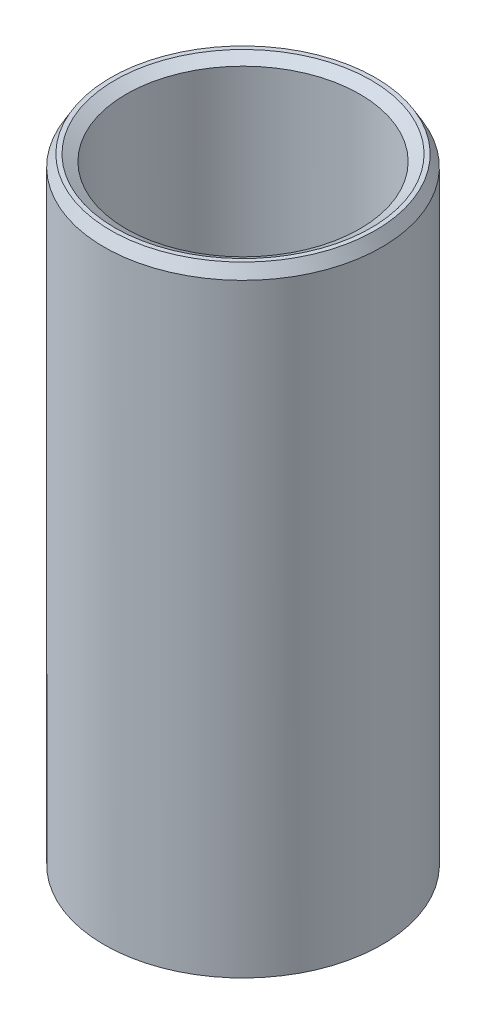
ISO-10303-21;
HEADER;
FILE_DESCRIPTION(('STEP AP214'),'2;1');
FILE_NAME('part.step','',(''),(''),'','','');
FILE_SCHEMA(('AUTOMOTIVE_DESIGN { 1 0 10303 214 1 1 1 1 }'));
ENDSEC;
DATA;
#1=APPLICATION_CONTEXT('core data for automotive mechanical design processes');
#2=APPLICATION_PROTOCOL_DEFINITION('international standard','automotive_design',2000,#1);
#3=PRODUCT_CONTEXT('',#1,'mechanical');
#4=PRODUCT('Part','Part','',(#3));
#5=PRODUCT_RELATED_PRODUCT_CATEGORY('part','',(#4));
#6=PRODUCT_DEFINITION_FORMATION('','',#4);
#7=PRODUCT_DEFINITION_CONTEXT('part definition',#1,'design');
#8=PRODUCT_DEFINITION('design','',#6,#7);
#9=PRODUCT_DEFINITION_SHAPE('','',#8);
#10=(LENGTH_UNIT() NAMED_UNIT(*) SI_UNIT(.MILLI.,.METRE.));
#11=(NAMED_UNIT(*) PLANE_ANGLE_UNIT() SI_UNIT($,.RADIAN.));
#12=(NAMED_UNIT(*) SI_UNIT($,.STERADIAN.) SOLID_ANGLE_UNIT());
#13=UNCERTAINTY_MEASURE_WITH_UNIT(LENGTH_MEASURE(1.E-05),#10,'distance_accuracy_value','');
#14=(GEOMETRIC_REPRESENTATION_CONTEXT(3) GLOBAL_UNCERTAINTY_ASSIGNED_CONTEXT((#13)) GLOBAL_UNIT_ASSIGNED_CONTEXT((#10,
#11,#12)) REPRESENTATION_CONTEXT('',''));
#15=CARTESIAN_POINT('',(0.,0.,0.));
#16=DIRECTION('',(0.,0.,1.));
#17=DIRECTION('',(1.,0.,0.));
#18=AXIS2_PLACEMENT_3D('',#15,#16,#17);
#19=CARTESIAN_POINT('',(0.,212.741151073881,0.));
#20=DIRECTION('',(0.,-1.,0.));
#21=DIRECTION('',(0.,0.,-1.));
#22=AXIS2_PLACEMENT_3D('',#19,#20,#21);
#23=CYLINDRICAL_SURFACE('',#22,47.5);
#24=CARTESIAN_POINT('',(0.,2.22241298728293,0.));
#25=DIRECTION('',(0.,1.,0.));
#26=DIRECTION('',(0.,0.,1.));
#27=AXIS2_PLACEMENT_3D('',#24,#25,#26);
#28=CIRCLE('',#27,47.5);
#29=CARTESIAN_POINT('',(0.,2.22241298728293,47.5));
#30=VERTEX_POINT('',#29);
#31=EDGE_CURVE('E10',#30,#30,#28,.T.);
#32=ORIENTED_EDGE('',*,*,#31,.T.);
#33=EDGE_LOOP('',(#32));
#34=FACE_BOUND('',#33,.T.);
#35=CARTESIAN_POINT('',(0.,208.891818864506,0.));
#36=DIRECTION('',(0.,1.,0.));
#37=DIRECTION('',(0.,0.,1.));
#38=AXIS2_PLACEMENT_3D('',#35,#36,#37);
#39=CIRCLE('',#38,47.5);
#40=CARTESIAN_POINT('',(0.,208.891818864506,-47.5));
#41=VERTEX_POINT('',#40);
#42=EDGE_CURVE('E50',#41,#41,#39,.F.);
#43=ORIENTED_EDGE('',*,*,#42,.T.);
#44=EDGE_LOOP('',(#43));
#45=FACE_BOUND('',#44,.T.);
#46=ADVANCED_FACE('F39',(#34,#45),#23,.T.);
#47=CARTESIAN_POINT('',(0.,212.741151073881,0.));
#48=DIRECTION('',(0.,1.,0.));
#49=DIRECTION('',(0.,0.,1.));
#50=AXIS2_PLACEMENT_3D('',#47,#48,#49);
#51=PLANE('',#50);
#52=CARTESIAN_POINT('',(0.,212.741151073881,0.));
#53=DIRECTION('',(0.,1.,0.));
#54=DIRECTION('',(0.,0.,1.));
#55=AXIS2_PLACEMENT_3D('',#52,#53,#54);
#56=CIRCLE('',#55,43.7968169123336);
#57=CARTESIAN_POINT('',(0.,212.741151073881,43.7968169123336));
#58=VERTEX_POINT('',#57);
#59=EDGE_CURVE('E58',#58,#58,#56,.F.);
#60=ORIENTED_EDGE('',*,*,#59,.T.);
#61=EDGE_LOOP('',(#60));
#62=FACE_BOUND('',#61,.T.);
#63=CARTESIAN_POINT('',(0.,212.741151073881,0.));
#64=DIRECTION('',(0.,1.,0.));
#65=DIRECTION('',(0.,0.,1.));
#66=AXIS2_PLACEMENT_3D('',#63,#64,#65);
#67=CIRCLE('',#66,45.2775870127171);
#68=CARTESIAN_POINT('',(0.,212.741151073881,-45.2775870127171));
#69=VERTEX_POINT('',#68);
#70=EDGE_CURVE('E61',#69,#69,#67,.T.);
#71=ORIENTED_EDGE('',*,*,#70,.T.);
#72=EDGE_LOOP('',(#71));
#73=FACE_BOUND('',#72,.T.);
#74=ADVANCED_FACE('F88',(#62,#73),#51,.T.);
#75=CARTESIAN_POINT('',(0.,0.,0.));
#76=DIRECTION('',(0.,1.,0.));
#77=DIRECTION('',(0.,0.,1.));
#78=AXIS2_PLACEMENT_3D('',#75,#76,#77);
#79=PLANE('',#78);
#80=CARTESIAN_POINT('',(0.,0.,0.));
#81=DIRECTION('',(0.,1.,0.));
#82=DIRECTION('',(0.,0.,1.));
#83=AXIS2_PLACEMENT_3D('',#80,#81,#82);
#84=CIRCLE('',#83,42.1698976902415);
#85=CARTESIAN_POINT('',(0.,0.,-42.1698976902415));
#86=VERTEX_POINT('',#85);
#87=EDGE_CURVE('E51',#86,#86,#84,.T.);
#88=ORIENTED_EDGE('',*,*,#87,.T.);
#89=EDGE_LOOP('',(#88));
#90=FACE_BOUND('',#89,.T.);
#91=CARTESIAN_POINT('',(0.,0.,0.));
#92=DIRECTION('',(0.,1.,0.));
#93=DIRECTION('',(0.,0.,1.));
#94=AXIS2_PLACEMENT_3D('',#91,#92,#93);
#95=CIRCLE('',#94,43.650667790625);
#96=CARTESIAN_POINT('',(0.,0.,43.650667790625));
#97=VERTEX_POINT('',#96);
#98=EDGE_CURVE('E54',#97,#97,#95,.F.);
#99=ORIENTED_EDGE('',*,*,#98,.T.);
#100=EDGE_LOOP('',(#99));
#101=FACE_BOUND('',#100,.T.);
#102=ADVANCED_FACE('F83',(#90,#101),#79,.F.);
#103=CARTESIAN_POINT('',(0.,212.741151073881,0.));
#104=DIRECTION('',(0.,-1.,0.));
#105=DIRECTION('',(0.,0.,-1.));
#106=AXIS2_PLACEMENT_3D('',#103,#104,#105);
#107=CYLINDRICAL_SURFACE('',#106,39.9474847029586);
#108=CARTESIAN_POINT('',(0.,210.518738086598,0.));
#109=DIRECTION('',(0.,1.,0.));
#110=DIRECTION('',(0.,0.,1.));
#111=AXIS2_PLACEMENT_3D('',#108,#109,#110);
#112=CIRCLE('',#111,39.9474847029586);
#113=CARTESIAN_POINT('',(0.,210.518738086598,39.9474847029586));
#114=VERTEX_POINT('',#113);
#115=EDGE_CURVE('E67',#114,#114,#112,.T.);
#116=ORIENTED_EDGE('',*,*,#115,.T.);
#117=EDGE_LOOP('',(#116));
#118=FACE_BOUND('',#117,.T.);
#119=CARTESIAN_POINT('',(0.,3.84933220937506,0.));
#120=DIRECTION('',(0.,1.,0.));
#121=DIRECTION('',(0.,0.,1.));
#122=AXIS2_PLACEMENT_3D('',#119,#120,#121);
#123=CIRCLE('',#122,39.9474847029586);
#124=CARTESIAN_POINT('',(0.,3.84933220937506,-39.9474847029586));
#125=VERTEX_POINT('',#124);
#126=EDGE_CURVE('E69',#125,#125,#123,.F.);
#127=ORIENTED_EDGE('',*,*,#126,.T.);
#128=EDGE_LOOP('',(#127));
#129=FACE_BOUND('',#128,.T.);
#130=ADVANCED_FACE('F71',(#118,#129),#107,.F.);
#131=CARTESIAN_POINT('',(0.,210.518738086598,0.));
#132=DIRECTION('',(0.,1.,0.));
#133=DIRECTION('',(0.,0.,1.));
#134=AXIS2_PLACEMENT_3D('',#131,#132,#133);
#135=CONICAL_SURFACE('',#134,39.9474847029586,1.0471975511966);
#136=ORIENTED_EDGE('',*,*,#59,.F.);
#137=EDGE_LOOP('',(#136));
#138=FACE_BOUND('',#137,.T.);
#139=ORIENTED_EDGE('',*,*,#115,.F.);
#140=EDGE_LOOP('',(#139));
#141=FACE_BOUND('',#140,.T.);
#142=ADVANCED_FACE('F77',(#138,#141),#135,.F.);
#143=CARTESIAN_POINT('',(0.,0.,0.));
#144=DIRECTION('',(0.,-1.,0.));
#145=DIRECTION('',(0.,0.,-1.));
#146=AXIS2_PLACEMENT_3D('',#143,#144,#145);
#147=CONICAL_SURFACE('',#146,42.1698976902415,0.523598775598296);
#148=CARTESIAN_POINT('',(0.,3.84933220937506,-39.9474847029586));
#149=CARTESIAN_POINT('',(0.,3.80923499886073,-39.9706348382428));
#150=CARTESIAN_POINT('',(0.,3.76913778834641,-39.993784973527));
#151=CARTESIAN_POINT('',(0.,3.68894336731776,-40.0400852440954));
#152=CARTESIAN_POINT('',(0.,3.64884615680344,-40.0632353793796));
#153=CARTESIAN_POINT('',(0.,3.56865173577479,-40.109535649948));
#154=CARTESIAN_POINT('',(0.,3.52855452526047,-40.1326857852321));
#155=CARTESIAN_POINT('',(0.,3.44836010423182,-40.1789860558006));
#156=CARTESIAN_POINT('',(0.,3.4082628937175,-40.2021361910847));
#157=CARTESIAN_POINT('',(0.,3.32806847268885,-40.2484364616531));
#158=CARTESIAN_POINT('',(0.,3.28797126217453,-40.2715865969373));
#159=CARTESIAN_POINT('',(0.,3.20777684114588,-40.3178868675057));
#160=CARTESIAN_POINT('',(0.,3.16767963063156,-40.3410370027899));
#161=CARTESIAN_POINT('',(0.,3.08748520960291,-40.3873372733583));
#162=CARTESIAN_POINT('',(0.,3.04738799908859,-40.4104874086425));
#163=CARTESIAN_POINT('',(0.,2.96719357805994,-40.4567876792109));
#164=CARTESIAN_POINT('',(0.,2.92709636754562,-40.4799378144951));
#165=CARTESIAN_POINT('',(0.,2.84690194651697,-40.5262380850635));
#166=CARTESIAN_POINT('',(0.,2.80680473600264,-40.5493882203477));
#167=CARTESIAN_POINT('',(0.,2.726610314974,-40.5956884909161));
#168=CARTESIAN_POINT('',(0.,2.68651310445967,-40.6188386262003));
#169=CARTESIAN_POINT('',(0.,2.60631868343103,-40.6651388967687));
#170=CARTESIAN_POINT('',(0.,2.5662214729167,-40.6882890320529));
#171=CARTESIAN_POINT('',(0.,2.48602705188806,-40.7345893026213));
#172=CARTESIAN_POINT('',(0.,2.44592984137373,-40.7577394379055));
#173=CARTESIAN_POINT('',(0.,2.36573542034509,-40.8040397084739));
#174=CARTESIAN_POINT('',(0.,2.32563820983076,-40.8271898437581));
#175=CARTESIAN_POINT('',(0.,2.24544378880212,-40.8734901143265));
#176=CARTESIAN_POINT('',(0.,2.20534657828779,-40.8966402496107));
#177=CARTESIAN_POINT('',(0.,2.12515215725914,-40.9429405201791));
#178=CARTESIAN_POINT('',(0.,2.08505494674482,-40.9660906554633));
#179=CARTESIAN_POINT('',(0.,2.00486052571617,-41.0123909260317));
#180=CARTESIAN_POINT('',(0.,1.96476331520185,-41.0355410613159));
#181=CARTESIAN_POINT('',(0.,1.8845688941732,-41.0818413318843));
#182=CARTESIAN_POINT('',(0.,1.84447168365888,-41.1049914671685));
#183=CARTESIAN_POINT('',(0.,1.76427726263023,-41.1512917377368));
#184=CARTESIAN_POINT('',(0.,1.72418005211591,-41.174441873021));
#185=CARTESIAN_POINT('',(0.,1.64398563108726,-41.2207421435894));
#186=CARTESIAN_POINT('',(0.,1.60388842057294,-41.2438922788736));
#187=CARTESIAN_POINT('',(0.,1.52369399954429,-41.290192549442));
#188=CARTESIAN_POINT('',(0.,1.48359678902997,-41.3133426847262));
#189=CARTESIAN_POINT('',(0.,1.40340236800132,-41.3596429552946));
#190=CARTESIAN_POINT('',(0.,1.363305157487,-41.3827930905788));
#191=CARTESIAN_POINT('',(0.,1.28311073645835,-41.4290933611472));
#192=CARTESIAN_POINT('',(0.,1.24301352594403,-41.4522434964314));
#193=CARTESIAN_POINT('',(0.,1.16281910491538,-41.4985437669998));
#194=CARTESIAN_POINT('',(0.,1.12272189440106,-41.521693902284));
#195=CARTESIAN_POINT('',(0.,1.04252747337241,-41.5679941728524));
#196=CARTESIAN_POINT('',(0.,1.00243026285809,-41.5911443081366));
#197=CARTESIAN_POINT('',(0.,0.92223584182944,-41.637444578705));
#198=CARTESIAN_POINT('',(0.,0.882138631315117,-41.6605947139892));
#199=CARTESIAN_POINT('',(0.,0.80194421028647,-41.7068949845576));
#200=CARTESIAN_POINT('',(0.,0.761846999772146,-41.7300451198418));
#201=CARTESIAN_POINT('',(0.,0.681652578743499,-41.7763453904102));
#202=CARTESIAN_POINT('',(0.,0.641555368229176,-41.7994955256944));
#203=CARTESIAN_POINT('',(0.,0.561360947200529,-41.8457957962628));
#204=CARTESIAN_POINT('',(0.,0.521263736686205,-41.868945931547));
#205=CARTESIAN_POINT('',(0.,0.441069315657558,-41.9152462021154));
#206=CARTESIAN_POINT('',(0.,0.400972105143235,-41.9383963373996));
#207=CARTESIAN_POINT('',(0.,0.320777684114588,-41.984696607968));
#208=CARTESIAN_POINT('',(0.,0.280680473600264,-42.0078467432522));
#209=CARTESIAN_POINT('',(0.,0.200486052571617,-42.0541470138206));
#210=CARTESIAN_POINT('',(0.,0.160388842057294,-42.0772971491048));
#211=CARTESIAN_POINT('',(0.,0.080194421028647,-42.1235974196731));
#212=CARTESIAN_POINT('',(0.,0.0400972105143235,-42.1467475549573));
#213=CARTESIAN_POINT('',(0.,0.,-42.1698976902415));
#214=B_SPLINE_CURVE_WITH_KNOTS('',3,(#148,#149,#150,#151,#152,#153,#154,#155,#156,#157,#158,
#159,#160,#161,#162,#163,#164,#165,#166,#167,#168,#169,#170,#171,#172,#173,#174,#175,#176,#177,
#178,#179,#180,#181,#182,#183,#184,#185,#186,#187,#188,#189,#190,#191,#192,#193,#194,#195,#196,
#197,#198,#199,#200,#201,#202,#203,#204,#205,#206,#207,#208,#209,#210,#211,#212,#213),
.UNSPECIFIED.,.F.,.F.,(4,2,2,2,2,2,2,2,2,2,2,2,2,2,2,2,2,2,2,2,2,2,2,2,2,2,2,2,2,2,2,2,4),(0.,
0.138900811705187,0.277801623410373,0.41670243511556,0.555603246820746,0.694504058525933,
0.833404870231119,0.972305681936306,1.11120649364149,1.25010730534668,1.38900811705186,
1.52790892875705,1.66680974046224,1.80571055216742,1.94461136387261,2.08351217557779,
2.22241298728298,2.36131379898817,2.50021461069335,2.63911542239854,2.77801623410373,
2.91691704580891,3.0558178575141,3.19471866921929,3.33361948092447,3.47252029262966,
3.61142110433484,3.75032191604003,3.88922272774522,4.0281235394504,4.16702435115559,
4.30592516286078,4.44482597456596),.UNSPECIFIED.);
#215=EDGE_CURVE('BSEAM73',#125,#86,#214,.T.);
#216=ORIENTED_EDGE('',*,*,#126,.F.);
#217=ORIENTED_EDGE('',*,*,#87,.F.);
#218=ORIENTED_EDGE('',*,*,#215,.T.);
#219=ORIENTED_EDGE('',*,*,#215,.F.);
#220=EDGE_LOOP('',(#216,#218,#217,#219));
#221=FACE_BOUND('',#220,.T.);
#222=ADVANCED_FACE('F73',(#221),#147,.F.);
#223=CARTESIAN_POINT('',(0.,2.22241298728293,0.));
#224=DIRECTION('',(0.,1.,0.));
#225=DIRECTION('',(0.,0.,1.));
#226=AXIS2_PLACEMENT_3D('',#223,#224,#225);
#227=CONICAL_SURFACE('',#226,47.5,1.0471975511966);
#228=ORIENTED_EDGE('',*,*,#98,.F.);
#229=EDGE_LOOP('',(#228));
#230=FACE_BOUND('',#229,.T.);
#231=ORIENTED_EDGE('',*,*,#31,.F.);
#232=EDGE_LOOP('',(#231));
#233=FACE_BOUND('',#232,.T.);
#234=ADVANCED_FACE('F76',(#230,#233),#227,.T.);
#235=CARTESIAN_POINT('',(0.,212.741151073881,0.));
#236=DIRECTION('',(0.,-1.,0.));
#237=DIRECTION('',(0.,0.,-1.));
#238=AXIS2_PLACEMENT_3D('',#235,#236,#237);
#239=CONICAL_SURFACE('',#238,45.2775870127171,0.52359877559829);
#240=CARTESIAN_POINT('',(0.,208.891818864506,-47.5));
#241=CARTESIAN_POINT('',(0.,208.931916075021,-47.4768498647158));
#242=CARTESIAN_POINT('',(0.,208.972013285535,-47.4536997294316));
#243=CARTESIAN_POINT('',(0.,209.052207706564,-47.4073994588632));
#244=CARTESIAN_POINT('',(0.,209.092304917078,-47.384249323579));
#245=CARTESIAN_POINT('',(0.,209.172499338107,-47.3379490530106));
#246=CARTESIAN_POINT('',(0.,209.212596548621,-47.3147989177264));
#247=CARTESIAN_POINT('',(0.,209.29279096965,-47.268498647158));
#248=CARTESIAN_POINT('',(0.,209.332888180164,-47.2453485118738));
#249=CARTESIAN_POINT('',(0.,209.413082601193,-47.1990482413055));
#250=CARTESIAN_POINT('',(0.,209.453179811707,-47.1758981060213));
#251=CARTESIAN_POINT('',(0.,209.533374232735,-47.1295978354529));
#252=CARTESIAN_POINT('',(0.,209.57347144325,-47.1064477001687));
#253=CARTESIAN_POINT('',(0.,209.653665864278,-47.0601474296003));
#254=CARTESIAN_POINT('',(0.,209.693763074793,-47.0369972943161));
#255=CARTESIAN_POINT('',(0.,209.773957495821,-46.9906970237477));
#256=CARTESIAN_POINT('',(0.,209.814054706336,-46.9675468884635));
#257=CARTESIAN_POINT('',(0.,209.894249127364,-46.9212466178951));
#258=CARTESIAN_POINT('',(0.,209.934346337879,-46.8980964826109));
#259=CARTESIAN_POINT('',(0.,210.014540758907,-46.8517962120425));
#260=CARTESIAN_POINT('',(0.,210.054637969422,-46.8286460767583));
#261=CARTESIAN_POINT('',(0.,210.13483239045,-46.7823458061899));
#262=CARTESIAN_POINT('',(0.,210.174929600965,-46.7591956709057));
#263=CARTESIAN_POINT('',(0.,210.255124021993,-46.7128954003373));
#264=CARTESIAN_POINT('',(0.,210.295221232508,-46.6897452650531));
#265=CARTESIAN_POINT('',(0.,210.375415653536,-46.6434449944847));
#266=CARTESIAN_POINT('',(0.,210.415512864051,-46.6202948592005));
#267=CARTESIAN_POINT('',(0.,210.495707285079,-46.5739945886321));
#268=CARTESIAN_POINT('',(0.,210.535804495594,-46.5508444533479));
#269=CARTESIAN_POINT('',(0.,210.615998916622,-46.5045441827795));
#270=CARTESIAN_POINT('',(0.,210.656096127137,-46.4813940474953));
#271=CARTESIAN_POINT('',(0.,210.736290548165,-46.4350937769269));
#272=CARTESIAN_POINT('',(0.,210.77638775868,-46.4119436416428));
#273=CARTESIAN_POINT('',(0.,210.856582179708,-46.3656433710744));
#274=CARTESIAN_POINT('',(0.,210.896679390222,-46.3424932357902));
#275=CARTESIAN_POINT('',(0.,210.976873811251,-46.2961929652218));
#276=CARTESIAN_POINT('',(0.,211.016971021765,-46.2730428299376));
#277=CARTESIAN_POINT('',(0.,211.097165442794,-46.2267425593692));
#278=CARTESIAN_POINT('',(0.,211.137262653308,-46.203592424085));
#279=CARTESIAN_POINT('',(0.,211.217457074337,-46.1572921535166));
#280=CARTESIAN_POINT('',(0.,211.257554284851,-46.1341420182324));
#281=CARTESIAN_POINT('',(0.,211.33774870588,-46.087841747664));
#282=CARTESIAN_POINT('',(0.,211.377845916394,-46.0646916123798));
#283=CARTESIAN_POINT('',(0.,211.458040337423,-46.0183913418114));
#284=CARTESIAN_POINT('',(0.,211.498137547937,-45.9952412065272));
#285=CARTESIAN_POINT('',(0.,211.578331968966,-45.9489409359588));
#286=CARTESIAN_POINT('',(0.,211.61842917948,-45.9257908006746));
#287=CARTESIAN_POINT('',(0.,211.698623600509,-45.8794905301062));
#288=CARTESIAN_POINT('',(0.,211.738720811023,-45.856340394822));
#289=CARTESIAN_POINT('',(0.,211.818915232052,-45.8100401242536));
#290=CARTESIAN_POINT('',(0.,211.859012442566,-45.7868899889694));
#291=CARTESIAN_POINT('',(0.,211.939206863595,-45.740589718401));
#292=CARTESIAN_POINT('',(0.,211.979304074109,-45.7174395831168));
#293=CARTESIAN_POINT('',(0.,212.059498495138,-45.6711393125484));
#294=CARTESIAN_POINT('',(0.,212.099595705652,-45.6479891772642));
#295=CARTESIAN_POINT('',(0.,212.179790126681,-45.6016889066958));
#296=CARTESIAN_POINT('',(0.,212.219887337195,-45.5785387714117));
#297=CARTESIAN_POINT('',(0.,212.300081758224,-45.5322385008433));
#298=CARTESIAN_POINT('',(0.,212.340178968738,-45.5090883655591));
#299=CARTESIAN_POINT('',(0.,212.420373389767,-45.4627880949907));
#300=CARTESIAN_POINT('',(0.,212.460470600281,-45.4396379597065));
#301=CARTESIAN_POINT('',(0.,212.54066502131,-45.3933376891381));
#302=CARTESIAN_POINT('',(0.,212.580762231824,-45.3701875538539));
#303=CARTESIAN_POINT('',(0.,212.660956652853,-45.3238872832855));
#304=CARTESIAN_POINT('',(0.,212.701053863367,-45.3007371480013));
#305=CARTESIAN_POINT('',(0.,212.741151073881,-45.2775870127171));
#306=B_SPLINE_CURVE_WITH_KNOTS('',3,(#240,#241,#242,#243,#244,#245,#246,#247,#248,#249,#250,
#251,#252,#253,#254,#255,#256,#257,#258,#259,#260,#261,#262,#263,#264,#265,#266,#267,#268,#269,
#270,#271,#272,#273,#274,#275,#276,#277,#278,#279,#280,#281,#282,#283,#284,#285,#286,#287,#288,
#289,#290,#291,#292,#293,#294,#295,#296,#297,#298,#299,#300,#301,#302,#303,#304,#305),
.UNSPECIFIED.,.F.,.F.,(4,2,2,2,2,2,2,2,2,2,2,2,2,2,2,2,2,2,2,2,2,2,2,2,2,2,2,2,2,2,2,2,4),(0.,
0.13890081170517,0.277801623410361,0.416702435115531,0.555603246820725,0.694504058525916,
0.833404870231086,0.97230568193628,1.11120649364147,1.25010730534664,1.38900811705183,
1.52790892875703,1.6668097404622,1.80571055216739,1.94461136387258,2.08351217557775,
2.22241298728294,2.36131379898814,2.50021461069331,2.6391154223985,2.77801623410369,
2.91691704580886,3.05581785751406,3.19471866921925,3.33361948092442,3.47252029262961,
3.6114211043348,3.75032191603997,3.88922272774517,4.02812353945036,4.16702435115553,
4.30592516286072,4.44482597456591),.UNSPECIFIED.);
#307=EDGE_CURVE('BSEAM45',#41,#69,#306,.T.);
#308=ORIENTED_EDGE('',*,*,#42,.F.);
#309=ORIENTED_EDGE('',*,*,#70,.F.);
#310=ORIENTED_EDGE('',*,*,#307,.T.);
#311=ORIENTED_EDGE('',*,*,#307,.F.);
#312=EDGE_LOOP('',(#308,#310,#309,#311));
#313=FACE_BOUND('',#312,.T.);
#314=ADVANCED_FACE('F45',(#313),#239,.T.);
#315=CLOSED_SHELL('',(#46,#74,#102,#130,#142,#222,#234,#314));
#316=MANIFOLD_SOLID_BREP('B2',#315);
#317=ADVANCED_BREP_SHAPE_REPRESENTATION('',(#18,#316),#14);
#318=SHAPE_DEFINITION_REPRESENTATION(#9,#317);
ENDSEC;
END-ISO-10303-21;
